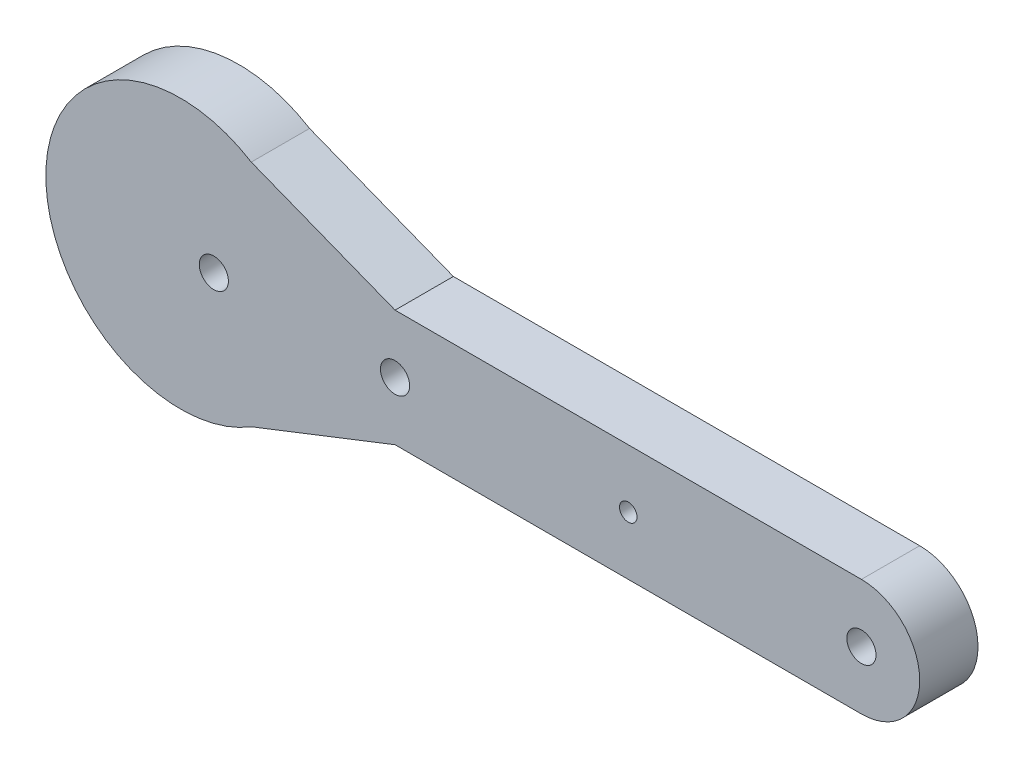
ISO-10303-21;
HEADER;
FILE_DESCRIPTION(('STEP AP214'),'2;1');
FILE_NAME('part.step','',(''),(''),'','','');
FILE_SCHEMA(('AUTOMOTIVE_DESIGN { 1 0 10303 214 1 1 1 1 }'));
ENDSEC;
DATA;
#1=APPLICATION_CONTEXT('core data for automotive mechanical design processes');
#2=APPLICATION_PROTOCOL_DEFINITION('international standard','automotive_design',2000,#1);
#3=PRODUCT_CONTEXT('',#1,'mechanical');
#4=PRODUCT('Part','Part','',(#3));
#5=PRODUCT_RELATED_PRODUCT_CATEGORY('part','',(#4));
#6=PRODUCT_DEFINITION_FORMATION('','',#4);
#7=PRODUCT_DEFINITION_CONTEXT('part definition',#1,'design');
#8=PRODUCT_DEFINITION('design','',#6,#7);
#9=PRODUCT_DEFINITION_SHAPE('','',#8);
#10=(LENGTH_UNIT() NAMED_UNIT(*) SI_UNIT(.MILLI.,.METRE.));
#11=(NAMED_UNIT(*) PLANE_ANGLE_UNIT() SI_UNIT($,.RADIAN.));
#12=(NAMED_UNIT(*) SI_UNIT($,.STERADIAN.) SOLID_ANGLE_UNIT());
#13=UNCERTAINTY_MEASURE_WITH_UNIT(LENGTH_MEASURE(1.E-05),#10,'distance_accuracy_value','');
#14=(GEOMETRIC_REPRESENTATION_CONTEXT(3) GLOBAL_UNCERTAINTY_ASSIGNED_CONTEXT((#13)) GLOBAL_UNIT_ASSIGNED_CONTEXT((#10,
#11,#12)) REPRESENTATION_CONTEXT('',''));
#15=CARTESIAN_POINT('',(0.,0.,0.));
#16=DIRECTION('',(0.,0.,1.));
#17=DIRECTION('',(1.,0.,0.));
#18=AXIS2_PLACEMENT_3D('',#15,#16,#17);
#19=CARTESIAN_POINT('',(-36.8077791148947,10.,-10.));
#20=DIRECTION('',(0.,0.,-1.));
#21=DIRECTION('',(1.,0.,0.));
#22=AXIS2_PLACEMENT_3D('',#19,#20,#21);
#23=PLANE('',#22);
#24=CARTESIAN_POINT('',(-31.0911194710237,10.,-10.));
#25=DIRECTION('',(0.,0.,1.));
#26=DIRECTION('',(1.,0.,0.));
#27=AXIS2_PLACEMENT_3D('',#24,#25,#26);
#28=CIRCLE('',#27,2.5);
#29=CARTESIAN_POINT('',(-28.5911194710237,10.,-10.));
#30=VERTEX_POINT('',#29);
#31=EDGE_CURVE('E158',#30,#30,#28,.T.);
#32=ORIENTED_EDGE('',*,*,#31,.T.);
#33=EDGE_LOOP('',(#32));
#34=FACE_BOUND('',#33,.T.);
#35=CARTESIAN_POINT('',(0.,10.,-10.));
#36=DIRECTION('',(0.,0.,1.));
#37=DIRECTION('',(1.,0.,0.));
#38=AXIS2_PLACEMENT_3D('',#35,#36,#37);
#39=CIRCLE('',#38,2.5);
#40=CARTESIAN_POINT('',(2.5,10.,-10.));
#41=VERTEX_POINT('',#40);
#42=EDGE_CURVE('E124',#41,#41,#39,.T.);
#43=ORIENTED_EDGE('',*,*,#42,.T.);
#44=EDGE_LOOP('',(#43));
#45=FACE_BOUND('',#44,.T.);
#46=DIRECTION('',(0.931166086788449,0.364595280845882,0.));
#47=VECTOR('',#46,1.);
#48=CARTESIAN_POINT('',(0.,0.,-10.));
#49=LINE('',#48,#47);
#50=CARTESIAN_POINT('',(-24.6672867580171,-9.65840194445181,-10.));
#51=VERTEX_POINT('',#50);
#52=CARTESIAN_POINT('',(0.,0.,-10.));
#53=VERTEX_POINT('',#52);
#54=EDGE_CURVE('E135',#51,#53,#49,.T.);
#55=ORIENTED_EDGE('',*,*,#54,.F.);
#56=CARTESIAN_POINT('',(-36.8077791148947,10.,-10.));
#57=DIRECTION('',(0.,0.,1.));
#58=DIRECTION('',(1.,0.,0.));
#59=AXIS2_PLACEMENT_3D('',#56,#57,#58);
#60=CIRCLE('',#59,23.1050713410937);
#61=CARTESIAN_POINT('',(-24.6672867580171,29.6584019444518,-10.));
#62=VERTEX_POINT('',#61);
#63=EDGE_CURVE('E115',#62,#51,#60,.T.);
#64=ORIENTED_EDGE('',*,*,#63,.F.);
#65=DIRECTION('',(-0.931166086788448,0.364595280845882,0.));
#66=VECTOR('',#65,1.);
#67=CARTESIAN_POINT('',(0.,20.,-10.));
#68=LINE('',#67,#66);
#69=CARTESIAN_POINT('',(0.,20.,-10.));
#70=VERTEX_POINT('',#69);
#71=EDGE_CURVE('E96',#70,#62,#68,.T.);
#72=ORIENTED_EDGE('',*,*,#71,.F.);
#73=DIRECTION('',(-1.,0.,0.));
#74=VECTOR('',#73,1.);
#75=CARTESIAN_POINT('',(0.,20.,-10.));
#76=LINE('',#75,#74);
#77=CARTESIAN_POINT('',(80.,20.,-10.));
#78=VERTEX_POINT('',#77);
#79=EDGE_CURVE('E106',#78,#70,#76,.T.);
#80=ORIENTED_EDGE('',*,*,#79,.F.);
#81=CARTESIAN_POINT('',(80.,10.,-10.));
#82=DIRECTION('',(0.,0.,1.));
#83=DIRECTION('',(-1.,0.,0.));
#84=AXIS2_PLACEMENT_3D('',#81,#82,#83);
#85=CIRCLE('',#84,10.);
#86=CARTESIAN_POINT('',(80.,0.,-10.));
#87=VERTEX_POINT('',#86);
#88=EDGE_CURVE('E111',#87,#78,#85,.T.);
#89=ORIENTED_EDGE('',*,*,#88,.F.);
#90=DIRECTION('',(1.,0.,0.));
#91=VECTOR('',#90,1.);
#92=CARTESIAN_POINT('',(0.,0.,-10.));
#93=LINE('',#92,#91);
#94=EDGE_CURVE('E140',#53,#87,#93,.T.);
#95=ORIENTED_EDGE('',*,*,#94,.F.);
#96=EDGE_LOOP('',(#55,#64,#72,#80,#89,#95));
#97=FACE_BOUND('',#96,.T.);
#98=CARTESIAN_POINT('',(80.,10.,-10.));
#99=DIRECTION('',(0.,0.,1.));
#100=DIRECTION('',(1.,0.,0.));
#101=AXIS2_PLACEMENT_3D('',#98,#99,#100);
#102=CIRCLE('',#101,2.50000000000001);
#103=CARTESIAN_POINT('',(82.5,10.,-10.));
#104=VERTEX_POINT('',#103);
#105=EDGE_CURVE('E152',#104,#104,#102,.T.);
#106=ORIENTED_EDGE('',*,*,#105,.T.);
#107=EDGE_LOOP('',(#106));
#108=FACE_BOUND('',#107,.T.);
#109=CARTESIAN_POINT('',(40.,9.99999999999999,-10.));
#110=DIRECTION('',(0.,0.,1.));
#111=DIRECTION('',(1.,0.,0.));
#112=AXIS2_PLACEMENT_3D('',#109,#110,#111);
#113=CIRCLE('',#112,1.5);
#114=CARTESIAN_POINT('',(41.5,9.99999999999999,-10.));
#115=VERTEX_POINT('',#114);
#116=EDGE_CURVE('E164',#115,#115,#113,.T.);
#117=ORIENTED_EDGE('',*,*,#116,.T.);
#118=EDGE_LOOP('',(#117));
#119=FACE_BOUND('',#118,.T.);
#120=ADVANCED_FACE('F35',(#34,#45,#97,#108,#119),#23,.T.);
#121=CARTESIAN_POINT('',(-36.8077791148947,10.,0.));
#122=DIRECTION('',(0.,0.,-1.));
#123=DIRECTION('',(1.,0.,0.));
#124=AXIS2_PLACEMENT_3D('',#121,#122,#123);
#125=PLANE('',#124);
#126=DIRECTION('',(0.931166086788449,0.364595280845882,0.));
#127=VECTOR('',#126,1.);
#128=CARTESIAN_POINT('',(0.,0.,0.));
#129=LINE('',#128,#127);
#130=CARTESIAN_POINT('',(-24.6672867580171,-9.65840194445181,0.));
#131=VERTEX_POINT('',#130);
#132=CARTESIAN_POINT('',(0.,0.,0.));
#133=VERTEX_POINT('',#132);
#134=EDGE_CURVE('E120',#131,#133,#129,.T.);
#135=ORIENTED_EDGE('',*,*,#134,.T.);
#136=DIRECTION('',(1.,0.,0.));
#137=VECTOR('',#136,1.);
#138=CARTESIAN_POINT('',(0.,0.,0.));
#139=LINE('',#138,#137);
#140=CARTESIAN_POINT('',(80.,0.,0.));
#141=VERTEX_POINT('',#140);
#142=EDGE_CURVE('E123',#133,#141,#139,.T.);
#143=ORIENTED_EDGE('',*,*,#142,.T.);
#144=CARTESIAN_POINT('',(80.,10.,0.));
#145=DIRECTION('',(0.,0.,1.));
#146=DIRECTION('',(-1.,0.,0.));
#147=AXIS2_PLACEMENT_3D('',#144,#145,#146);
#148=CIRCLE('',#147,10.);
#149=CARTESIAN_POINT('',(80.,20.,0.));
#150=VERTEX_POINT('',#149);
#151=EDGE_CURVE('E127',#141,#150,#148,.T.);
#152=ORIENTED_EDGE('',*,*,#151,.T.);
#153=DIRECTION('',(-1.,0.,0.));
#154=VECTOR('',#153,1.);
#155=CARTESIAN_POINT('',(0.,20.,0.));
#156=LINE('',#155,#154);
#157=CARTESIAN_POINT('',(0.,20.,0.));
#158=VERTEX_POINT('',#157);
#159=EDGE_CURVE('E130',#150,#158,#156,.T.);
#160=ORIENTED_EDGE('',*,*,#159,.T.);
#161=DIRECTION('',(-0.931166086788448,0.364595280845882,0.));
#162=VECTOR('',#161,1.);
#163=CARTESIAN_POINT('',(0.,20.,0.));
#164=LINE('',#163,#162);
#165=CARTESIAN_POINT('',(-24.6672867580171,29.6584019444518,0.));
#166=VERTEX_POINT('',#165);
#167=EDGE_CURVE('E99',#158,#166,#164,.T.);
#168=ORIENTED_EDGE('',*,*,#167,.T.);
#169=CARTESIAN_POINT('',(-36.8077791148947,10.,0.));
#170=DIRECTION('',(0.,0.,1.));
#171=DIRECTION('',(1.,0.,0.));
#172=AXIS2_PLACEMENT_3D('',#169,#170,#171);
#173=CIRCLE('',#172,23.1050713410937);
#174=EDGE_CURVE('E133',#166,#131,#173,.T.);
#175=ORIENTED_EDGE('',*,*,#174,.T.);
#176=EDGE_LOOP('',(#135,#143,#152,#160,#168,#175));
#177=FACE_BOUND('',#176,.T.);
#178=CARTESIAN_POINT('',(0.,10.,0.));
#179=DIRECTION('',(0.,0.,1.));
#180=DIRECTION('',(1.,0.,0.));
#181=AXIS2_PLACEMENT_3D('',#178,#179,#180);
#182=CIRCLE('',#181,2.5);
#183=CARTESIAN_POINT('',(2.5,10.,0.));
#184=VERTEX_POINT('',#183);
#185=EDGE_CURVE('E149',#184,#184,#182,.T.);
#186=ORIENTED_EDGE('',*,*,#185,.F.);
#187=EDGE_LOOP('',(#186));
#188=FACE_BOUND('',#187,.T.);
#189=CARTESIAN_POINT('',(80.,10.,0.));
#190=DIRECTION('',(0.,0.,1.));
#191=DIRECTION('',(1.,0.,0.));
#192=AXIS2_PLACEMENT_3D('',#189,#190,#191);
#193=CIRCLE('',#192,2.50000000000001);
#194=CARTESIAN_POINT('',(82.5,10.,0.));
#195=VERTEX_POINT('',#194);
#196=EDGE_CURVE('E155',#195,#195,#193,.T.);
#197=ORIENTED_EDGE('',*,*,#196,.F.);
#198=EDGE_LOOP('',(#197));
#199=FACE_BOUND('',#198,.T.);
#200=CARTESIAN_POINT('',(-31.0911194710237,10.,0.));
#201=DIRECTION('',(0.,0.,1.));
#202=DIRECTION('',(1.,0.,0.));
#203=AXIS2_PLACEMENT_3D('',#200,#201,#202);
#204=CIRCLE('',#203,2.5);
#205=CARTESIAN_POINT('',(-28.5911194710237,10.,0.));
#206=VERTEX_POINT('',#205);
#207=EDGE_CURVE('E161',#206,#206,#204,.T.);
#208=ORIENTED_EDGE('',*,*,#207,.F.);
#209=EDGE_LOOP('',(#208));
#210=FACE_BOUND('',#209,.T.);
#211=CARTESIAN_POINT('',(40.,9.99999999999999,0.));
#212=DIRECTION('',(0.,0.,1.));
#213=DIRECTION('',(1.,0.,0.));
#214=AXIS2_PLACEMENT_3D('',#211,#212,#213);
#215=CIRCLE('',#214,1.5);
#216=CARTESIAN_POINT('',(41.5,9.99999999999999,0.));
#217=VERTEX_POINT('',#216);
#218=EDGE_CURVE('E167',#217,#217,#215,.T.);
#219=ORIENTED_EDGE('',*,*,#218,.F.);
#220=EDGE_LOOP('',(#219));
#221=FACE_BOUND('',#220,.T.);
#222=ADVANCED_FACE('F144',(#177,#188,#199,#210,#221),#125,.F.);
#223=CARTESIAN_POINT('',(0.,0.,-10.));
#224=DIRECTION('',(-0.364595280845882,0.931166086788449,0.));
#225=DIRECTION('',(-0.931166086788449,-0.364595280845882,0.));
#226=AXIS2_PLACEMENT_3D('',#223,#224,#225);
#227=PLANE('',#226);
#228=ORIENTED_EDGE('',*,*,#134,.F.);
#229=DIRECTION('',(0.,0.,1.));
#230=VECTOR('',#229,1.);
#231=CARTESIAN_POINT('',(-24.6672867580171,-9.65840194445181,-10.));
#232=LINE('',#231,#230);
#233=EDGE_CURVE('E52',#51,#131,#232,.T.);
#234=ORIENTED_EDGE('',*,*,#233,.F.);
#235=ORIENTED_EDGE('',*,*,#54,.T.);
#236=DIRECTION('',(0.,0.,1.));
#237=VECTOR('',#236,1.);
#238=CARTESIAN_POINT('',(0.,0.,-10.));
#239=LINE('',#238,#237);
#240=EDGE_CURVE('E11',#53,#133,#239,.T.);
#241=ORIENTED_EDGE('',*,*,#240,.T.);
#242=EDGE_LOOP('',(#228,#234,#235,#241));
#243=FACE_BOUND('',#242,.T.);
#244=ADVANCED_FACE('F37',(#243),#227,.F.);
#245=CARTESIAN_POINT('',(0.,0.,-10.));
#246=DIRECTION('',(0.,1.,0.));
#247=DIRECTION('',(0.,0.,-1.));
#248=AXIS2_PLACEMENT_3D('',#245,#246,#247);
#249=PLANE('',#248);
#250=ORIENTED_EDGE('',*,*,#142,.F.);
#251=ORIENTED_EDGE('',*,*,#240,.F.);
#252=ORIENTED_EDGE('',*,*,#94,.T.);
#253=DIRECTION('',(0.,0.,1.));
#254=VECTOR('',#253,1.);
#255=CARTESIAN_POINT('',(80.,0.,-10.));
#256=LINE('',#255,#254);
#257=EDGE_CURVE('E44',#87,#141,#256,.T.);
#258=ORIENTED_EDGE('',*,*,#257,.T.);
#259=EDGE_LOOP('',(#250,#251,#252,#258));
#260=FACE_BOUND('',#259,.T.);
#261=ADVANCED_FACE('F139',(#260),#249,.F.);
#262=CARTESIAN_POINT('',(80.,10.,-10.));
#263=DIRECTION('',(0.,0.,1.));
#264=DIRECTION('',(-1.,0.,0.));
#265=AXIS2_PLACEMENT_3D('',#262,#263,#264);
#266=CYLINDRICAL_SURFACE('',#265,10.);
#267=ORIENTED_EDGE('',*,*,#151,.F.);
#268=ORIENTED_EDGE('',*,*,#257,.F.);
#269=ORIENTED_EDGE('',*,*,#88,.T.);
#270=DIRECTION('',(0.,0.,1.));
#271=VECTOR('',#270,1.);
#272=CARTESIAN_POINT('',(80.,20.,-10.));
#273=LINE('',#272,#271);
#274=EDGE_CURVE('E103',#78,#150,#273,.T.);
#275=ORIENTED_EDGE('',*,*,#274,.T.);
#276=EDGE_LOOP('',(#267,#268,#269,#275));
#277=FACE_BOUND('',#276,.T.);
#278=ADVANCED_FACE('F142',(#277),#266,.T.);
#279=CARTESIAN_POINT('',(0.,20.,-10.));
#280=DIRECTION('',(0.,-1.,0.));
#281=DIRECTION('',(0.,0.,1.));
#282=AXIS2_PLACEMENT_3D('',#279,#280,#281);
#283=PLANE('',#282);
#284=ORIENTED_EDGE('',*,*,#159,.F.);
#285=ORIENTED_EDGE('',*,*,#274,.F.);
#286=ORIENTED_EDGE('',*,*,#79,.T.);
#287=DIRECTION('',(0.,0.,1.));
#288=VECTOR('',#287,1.);
#289=CARTESIAN_POINT('',(0.,20.,-10.));
#290=LINE('',#289,#288);
#291=EDGE_CURVE('E92',#70,#158,#290,.T.);
#292=ORIENTED_EDGE('',*,*,#291,.T.);
#293=EDGE_LOOP('',(#284,#285,#286,#292));
#294=FACE_BOUND('',#293,.T.);
#295=ADVANCED_FACE('F107',(#294),#283,.F.);
#296=CARTESIAN_POINT('',(0.,20.,-10.));
#297=DIRECTION('',(-0.364595280845882,-0.931166086788449,0.));
#298=DIRECTION('',(0.931166086788449,-0.364595280845882,0.));
#299=AXIS2_PLACEMENT_3D('',#296,#297,#298);
#300=PLANE('',#299);
#301=ORIENTED_EDGE('',*,*,#167,.F.);
#302=ORIENTED_EDGE('',*,*,#291,.F.);
#303=ORIENTED_EDGE('',*,*,#71,.T.);
#304=DIRECTION('',(0.,0.,1.));
#305=VECTOR('',#304,1.);
#306=CARTESIAN_POINT('',(-24.6672867580171,29.6584019444518,-10.));
#307=LINE('',#306,#305);
#308=EDGE_CURVE('E74',#62,#166,#307,.T.);
#309=ORIENTED_EDGE('',*,*,#308,.T.);
#310=EDGE_LOOP('',(#301,#302,#303,#309));
#311=FACE_BOUND('',#310,.T.);
#312=ADVANCED_FACE('F94',(#311),#300,.F.);
#313=CARTESIAN_POINT('',(-36.8077791148947,10.,-10.));
#314=DIRECTION('',(0.,0.,1.));
#315=DIRECTION('',(-1.,0.,0.));
#316=AXIS2_PLACEMENT_3D('',#313,#314,#315);
#317=CYLINDRICAL_SURFACE('',#316,23.1050713410937);
#318=ORIENTED_EDGE('',*,*,#174,.F.);
#319=ORIENTED_EDGE('',*,*,#308,.F.);
#320=ORIENTED_EDGE('',*,*,#63,.T.);
#321=ORIENTED_EDGE('',*,*,#233,.T.);
#322=EDGE_LOOP('',(#318,#319,#320,#321));
#323=FACE_BOUND('',#322,.T.);
#324=ADVANCED_FACE('F191',(#323),#317,.T.);
#325=CARTESIAN_POINT('',(0.,10.,-10.));
#326=DIRECTION('',(0.,0.,1.));
#327=DIRECTION('',(-1.,0.,0.));
#328=AXIS2_PLACEMENT_3D('',#325,#326,#327);
#329=CYLINDRICAL_SURFACE('',#328,2.5);
#330=ORIENTED_EDGE('',*,*,#42,.F.);
#331=EDGE_LOOP('',(#330));
#332=FACE_BOUND('',#331,.T.);
#333=ORIENTED_EDGE('',*,*,#185,.T.);
#334=EDGE_LOOP('',(#333));
#335=FACE_BOUND('',#334,.T.);
#336=ADVANCED_FACE('F194',(#332,#335),#329,.F.);
#337=CARTESIAN_POINT('',(80.,10.,-10.));
#338=DIRECTION('',(0.,0.,1.));
#339=DIRECTION('',(-1.,0.,0.));
#340=AXIS2_PLACEMENT_3D('',#337,#338,#339);
#341=CYLINDRICAL_SURFACE('',#340,2.50000000000001);
#342=ORIENTED_EDGE('',*,*,#105,.F.);
#343=EDGE_LOOP('',(#342));
#344=FACE_BOUND('',#343,.T.);
#345=ORIENTED_EDGE('',*,*,#196,.T.);
#346=EDGE_LOOP('',(#345));
#347=FACE_BOUND('',#346,.T.);
#348=ADVANCED_FACE('F227',(#344,#347),#341,.F.);
#349=CARTESIAN_POINT('',(-31.0911194710237,10.,-10.));
#350=DIRECTION('',(0.,0.,1.));
#351=DIRECTION('',(-1.,0.,0.));
#352=AXIS2_PLACEMENT_3D('',#349,#350,#351);
#353=CYLINDRICAL_SURFACE('',#352,2.5);
#354=ORIENTED_EDGE('',*,*,#31,.F.);
#355=EDGE_LOOP('',(#354));
#356=FACE_BOUND('',#355,.T.);
#357=ORIENTED_EDGE('',*,*,#207,.T.);
#358=EDGE_LOOP('',(#357));
#359=FACE_BOUND('',#358,.T.);
#360=ADVANCED_FACE('F177',(#356,#359),#353,.F.);
#361=CARTESIAN_POINT('',(40.,9.99999999999999,-10.));
#362=DIRECTION('',(0.,0.,1.));
#363=DIRECTION('',(-1.,0.,0.));
#364=AXIS2_PLACEMENT_3D('',#361,#362,#363);
#365=CYLINDRICAL_SURFACE('',#364,1.5);
#366=ORIENTED_EDGE('',*,*,#116,.F.);
#367=EDGE_LOOP('',(#366));
#368=FACE_BOUND('',#367,.T.);
#369=ORIENTED_EDGE('',*,*,#218,.T.);
#370=EDGE_LOOP('',(#369));
#371=FACE_BOUND('',#370,.T.);
#372=ADVANCED_FACE('F174',(#368,#371),#365,.F.);
#373=CLOSED_SHELL('',(#120,#222,#244,#261,#278,#295,#312,#324,#336,#348,#360,#372));
#374=MANIFOLD_SOLID_BREP('B2',#373);
#375=ADVANCED_BREP_SHAPE_REPRESENTATION('',(#18,#374),#14);
#376=SHAPE_DEFINITION_REPRESENTATION(#9,#375);
ENDSEC;
END-ISO-10303-21;
